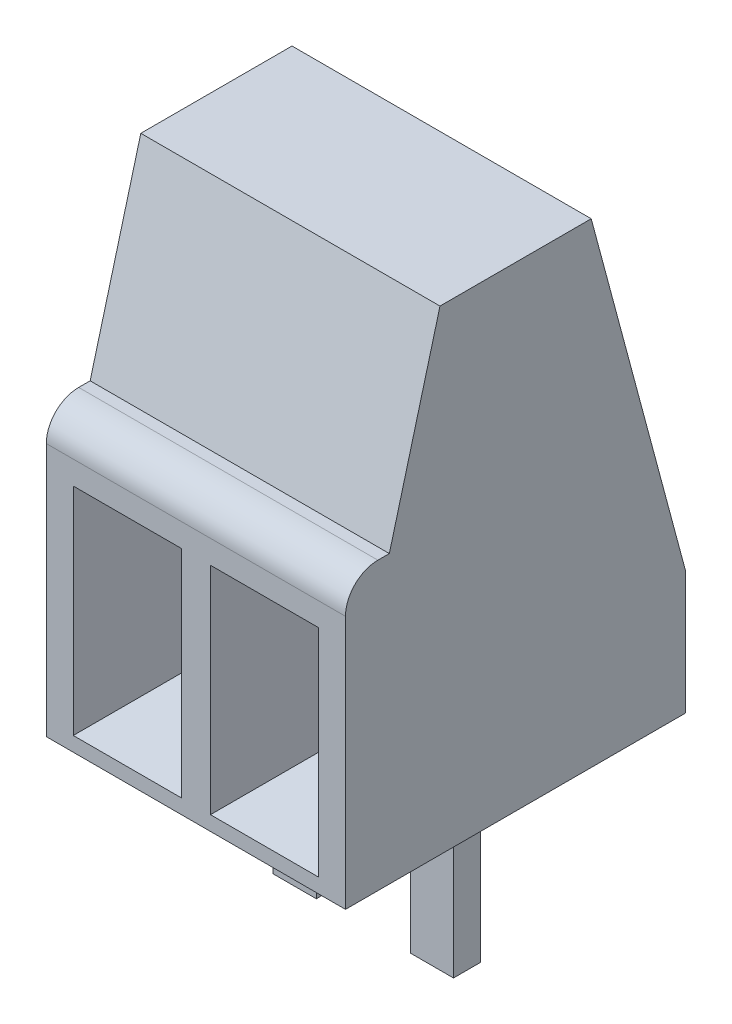
ISO-10303-21;
HEADER;
FILE_DESCRIPTION(('STEP AP214'),'2;1');
FILE_NAME('part.step','',(''),(''),'','','');
FILE_SCHEMA(('AUTOMOTIVE_DESIGN { 1 0 10303 214 1 1 1 1 }'));
ENDSEC;
DATA;
#1=APPLICATION_CONTEXT('core data for automotive mechanical design processes');
#2=APPLICATION_PROTOCOL_DEFINITION('international standard','automotive_design',2000,#1);
#3=PRODUCT_CONTEXT('',#1,'mechanical');
#4=PRODUCT('Part','Part','',(#3));
#5=PRODUCT_RELATED_PRODUCT_CATEGORY('part','',(#4));
#6=PRODUCT_DEFINITION_FORMATION('','',#4);
#7=PRODUCT_DEFINITION_CONTEXT('part definition',#1,'design');
#8=PRODUCT_DEFINITION('design','',#6,#7);
#9=PRODUCT_DEFINITION_SHAPE('','',#8);
#10=(LENGTH_UNIT() NAMED_UNIT(*) SI_UNIT(.MILLI.,.METRE.));
#11=(NAMED_UNIT(*) PLANE_ANGLE_UNIT() SI_UNIT($,.RADIAN.));
#12=(NAMED_UNIT(*) SI_UNIT($,.STERADIAN.) SOLID_ANGLE_UNIT());
#13=UNCERTAINTY_MEASURE_WITH_UNIT(LENGTH_MEASURE(1.E-05),#10,'distance_accuracy_value','');
#14=(GEOMETRIC_REPRESENTATION_CONTEXT(3) GLOBAL_UNCERTAINTY_ASSIGNED_CONTEXT((#13)) GLOBAL_UNIT_ASSIGNED_CONTEXT((#10,
#11,#12)) REPRESENTATION_CONTEXT('',''));
#15=CARTESIAN_POINT('',(0.,0.,0.));
#16=DIRECTION('',(0.,0.,1.));
#17=DIRECTION('',(1.,0.,0.));
#18=AXIS2_PLACEMENT_3D('',#15,#16,#17);
#19=CARTESIAN_POINT('',(2.77,8.8,3.15));
#20=DIRECTION('',(-1.,0.,0.));
#21=DIRECTION('',(0.,0.,1.));
#22=AXIS2_PLACEMENT_3D('',#19,#20,#21);
#23=PLANE('',#22);
#24=DIRECTION('',(0.,0.,-1.));
#25=VECTOR('',#24,1.);
#26=CARTESIAN_POINT('',(2.77,8.8,3.15));
#27=LINE('',#26,#25);
#28=CARTESIAN_POINT('',(2.77,8.8,1.4));
#29=VERTEX_POINT('',#28);
#30=CARTESIAN_POINT('',(2.77,8.8,-1.4));
#31=VERTEX_POINT('',#30);
#32=EDGE_CURVE('E361',#29,#31,#27,.T.);
#33=ORIENTED_EDGE('',*,*,#32,.F.);
#34=DIRECTION('',(0.,0.965925826289069,-0.258819045102518));
#35=VECTOR('',#34,1.);
#36=CARTESIAN_POINT('',(2.77,0.939488223348452,3.50621778264909));
#37=LINE('',#36,#35);
#38=CARTESIAN_POINT('',(2.77,5.3,2.33782217350892));
#39=VERTEX_POINT('',#38);
#40=EDGE_CURVE('E276',#39,#29,#37,.T.);
#41=ORIENTED_EDGE('',*,*,#40,.F.);
#42=DIRECTION('',(0.,0.,-1.));
#43=VECTOR('',#42,1.);
#44=CARTESIAN_POINT('',(2.77,5.3,0.));
#45=LINE('',#44,#43);
#46=CARTESIAN_POINT('',(2.77,5.3,2.55));
#47=VERTEX_POINT('',#46);
#48=EDGE_CURVE('E273',#47,#39,#45,.T.);
#49=ORIENTED_EDGE('',*,*,#48,.F.);
#50=CARTESIAN_POINT('',(2.77,4.7,2.55));
#51=DIRECTION('',(1.,0.,0.));
#52=DIRECTION('',(0.,0.,-1.));
#53=AXIS2_PLACEMENT_3D('',#50,#51,#52);
#54=CIRCLE('',#53,0.599999999999999);
#55=CARTESIAN_POINT('',(2.77,4.7,3.15));
#56=VERTEX_POINT('',#55);
#57=EDGE_CURVE('E270',#56,#47,#54,.F.);
#58=ORIENTED_EDGE('',*,*,#57,.F.);
#59=DIRECTION('',(0.,-1.,0.));
#60=VECTOR('',#59,1.);
#61=CARTESIAN_POINT('',(2.77,8.8,3.15));
#62=LINE('',#61,#60);
#63=CARTESIAN_POINT('',(2.77,0.,3.15));
#64=VERTEX_POINT('',#63);
#65=EDGE_CURVE('E368',#56,#64,#62,.T.);
#66=ORIENTED_EDGE('',*,*,#65,.T.);
#67=DIRECTION('',(0.,0.,-1.));
#68=VECTOR('',#67,1.);
#69=CARTESIAN_POINT('',(2.77,0.,3.15));
#70=LINE('',#69,#68);
#71=CARTESIAN_POINT('',(2.77,0.,-3.15));
#72=VERTEX_POINT('',#71);
#73=EDGE_CURVE('E352',#64,#72,#70,.T.);
#74=ORIENTED_EDGE('',*,*,#73,.T.);
#75=DIRECTION('',(0.,-1.,0.));
#76=VECTOR('',#75,1.);
#77=CARTESIAN_POINT('',(2.77,8.8,-3.15));
#78=LINE('',#77,#76);
#79=CARTESIAN_POINT('',(2.77,2.26891108675449,-3.15));
#80=VERTEX_POINT('',#79);
#81=EDGE_CURVE('E11',#80,#72,#78,.T.);
#82=ORIENTED_EDGE('',*,*,#81,.F.);
#83=DIRECTION('',(0.,-0.965925826289068,-0.258819045102522));
#84=VECTOR('',#83,1.);
#85=CARTESIAN_POINT('',(2.77,0.939488223348475,-3.50621778264911));
#86=LINE('',#85,#84);
#87=EDGE_CURVE('E222',#31,#80,#86,.T.);
#88=ORIENTED_EDGE('',*,*,#87,.F.);
#89=EDGE_LOOP('',(#33,#41,#49,#58,#66,#74,#82,#88));
#90=FACE_BOUND('',#89,.T.);
#91=ADVANCED_FACE('F33',(#90),#23,.F.);
#92=CARTESIAN_POINT('',(-2.77,8.8,-3.15));
#93=DIRECTION('',(0.,0.,1.));
#94=DIRECTION('',(1.,0.,0.));
#95=AXIS2_PLACEMENT_3D('',#92,#93,#94);
#96=PLANE('',#95);
#97=DIRECTION('',(0.,-1.,0.));
#98=VECTOR('',#97,1.);
#99=CARTESIAN_POINT('',(-2.77,8.8,-3.15));
#100=LINE('',#99,#98);
#101=CARTESIAN_POINT('',(-2.77,2.26891108675449,-3.15));
#102=VERTEX_POINT('',#101);
#103=CARTESIAN_POINT('',(-2.77,0.,-3.15));
#104=VERTEX_POINT('',#103);
#105=EDGE_CURVE('E40',#102,#104,#100,.T.);
#106=ORIENTED_EDGE('',*,*,#105,.F.);
#107=DIRECTION('',(1.,0.,0.));
#108=VECTOR('',#107,1.);
#109=CARTESIAN_POINT('',(-2.771,2.26891108675449,-3.15));
#110=LINE('',#109,#108);
#111=EDGE_CURVE('E292',#102,#80,#110,.T.);
#112=ORIENTED_EDGE('',*,*,#111,.T.);
#113=ORIENTED_EDGE('',*,*,#81,.T.);
#114=DIRECTION('',(-1.,0.,0.));
#115=VECTOR('',#114,1.);
#116=CARTESIAN_POINT('',(-2.77,0.,-3.15));
#117=LINE('',#116,#115);
#118=EDGE_CURVE('E371',#72,#104,#117,.T.);
#119=ORIENTED_EDGE('',*,*,#118,.T.);
#120=EDGE_LOOP('',(#106,#112,#113,#119));
#121=FACE_BOUND('',#120,.T.);
#122=ADVANCED_FACE('F392',(#121),#96,.F.);
#123=CARTESIAN_POINT('',(-2.77,8.8,3.15));
#124=DIRECTION('',(1.,0.,0.));
#125=DIRECTION('',(0.,0.,-1.));
#126=AXIS2_PLACEMENT_3D('',#123,#124,#125);
#127=PLANE('',#126);
#128=DIRECTION('',(0.,0.,1.));
#129=VECTOR('',#128,1.);
#130=CARTESIAN_POINT('',(-2.77,5.3,0.));
#131=LINE('',#130,#129);
#132=CARTESIAN_POINT('',(-2.77,5.3,2.33782217350892));
#133=VERTEX_POINT('',#132);
#134=CARTESIAN_POINT('',(-2.77,5.3,2.55));
#135=VERTEX_POINT('',#134);
#136=EDGE_CURVE('E263',#133,#135,#131,.T.);
#137=ORIENTED_EDGE('',*,*,#136,.F.);
#138=DIRECTION('',(0.,-0.965925826289069,0.258819045102518));
#139=VECTOR('',#138,1.);
#140=CARTESIAN_POINT('',(-2.77,0.939488223348452,3.50621778264909));
#141=LINE('',#140,#139);
#142=CARTESIAN_POINT('',(-2.77,8.8,1.4));
#143=VERTEX_POINT('',#142);
#144=EDGE_CURVE('E266',#143,#133,#141,.T.);
#145=ORIENTED_EDGE('',*,*,#144,.F.);
#146=DIRECTION('',(0.,0.,1.));
#147=VECTOR('',#146,1.);
#148=CARTESIAN_POINT('',(-2.77,8.8,3.15));
#149=LINE('',#148,#147);
#150=CARTESIAN_POINT('',(-2.77,8.8,-1.4));
#151=VERTEX_POINT('',#150);
#152=EDGE_CURVE('E364',#151,#143,#149,.T.);
#153=ORIENTED_EDGE('',*,*,#152,.F.);
#154=DIRECTION('',(0.,0.965925826289068,0.258819045102522));
#155=VECTOR('',#154,1.);
#156=CARTESIAN_POINT('',(-2.77,0.939488223348475,-3.50621778264911));
#157=LINE('',#156,#155);
#158=EDGE_CURVE('E267',#102,#151,#157,.T.);
#159=ORIENTED_EDGE('',*,*,#158,.F.);
#160=ORIENTED_EDGE('',*,*,#105,.T.);
#161=DIRECTION('',(0.,0.,1.));
#162=VECTOR('',#161,1.);
#163=CARTESIAN_POINT('',(-2.77,0.,3.15));
#164=LINE('',#163,#162);
#165=CARTESIAN_POINT('',(-2.77,0.,3.15));
#166=VERTEX_POINT('',#165);
#167=EDGE_CURVE('E374',#104,#166,#164,.T.);
#168=ORIENTED_EDGE('',*,*,#167,.T.);
#169=DIRECTION('',(0.,-1.,0.));
#170=VECTOR('',#169,1.);
#171=CARTESIAN_POINT('',(-2.77,8.8,3.15));
#172=LINE('',#171,#170);
#173=CARTESIAN_POINT('',(-2.77,4.7,3.15));
#174=VERTEX_POINT('',#173);
#175=EDGE_CURVE('E380',#174,#166,#172,.T.);
#176=ORIENTED_EDGE('',*,*,#175,.F.);
#177=CARTESIAN_POINT('',(-2.77,4.7,2.55));
#178=DIRECTION('',(1.,0.,0.));
#179=DIRECTION('',(0.,0.,-1.));
#180=AXIS2_PLACEMENT_3D('',#177,#178,#179);
#181=CIRCLE('',#180,0.599999999999999);
#182=EDGE_CURVE('E282',#135,#174,#181,.T.);
#183=ORIENTED_EDGE('',*,*,#182,.F.);
#184=EDGE_LOOP('',(#137,#145,#153,#159,#160,#168,#176,#183));
#185=FACE_BOUND('',#184,.T.);
#186=ADVANCED_FACE('F385',(#185),#127,.F.);
#187=CARTESIAN_POINT('',(-2.77,8.8,3.15));
#188=DIRECTION('',(0.,0.,-1.));
#189=DIRECTION('',(-1.,0.,0.));
#190=AXIS2_PLACEMENT_3D('',#187,#188,#189);
#191=PLANE('',#190);
#192=DIRECTION('',(-1.,0.,0.));
#193=VECTOR('',#192,1.);
#194=CARTESIAN_POINT('',(-2.27,4.26891108675449,3.15));
#195=LINE('',#194,#193);
#196=CARTESIAN_POINT('',(-0.27,4.26891108675449,3.15));
#197=VERTEX_POINT('',#196);
#198=CARTESIAN_POINT('',(-2.27,4.26891108675449,3.15));
#199=VERTEX_POINT('',#198);
#200=EDGE_CURVE('E207',#197,#199,#195,.T.);
#201=ORIENTED_EDGE('',*,*,#200,.F.);
#202=DIRECTION('',(0.,1.,0.));
#203=VECTOR('',#202,1.);
#204=CARTESIAN_POINT('',(-0.27,0.268911086754488,3.15));
#205=LINE('',#204,#203);
#206=CARTESIAN_POINT('',(-0.27,0.268911086754488,3.15));
#207=VERTEX_POINT('',#206);
#208=EDGE_CURVE('E47',#207,#197,#205,.T.);
#209=ORIENTED_EDGE('',*,*,#208,.F.);
#210=DIRECTION('',(1.,0.,0.));
#211=VECTOR('',#210,1.);
#212=CARTESIAN_POINT('',(-2.27,0.268911086754488,3.15));
#213=LINE('',#212,#211);
#214=CARTESIAN_POINT('',(-2.27,0.268911086754488,3.15));
#215=VERTEX_POINT('',#214);
#216=EDGE_CURVE('E214',#215,#207,#213,.T.);
#217=ORIENTED_EDGE('',*,*,#216,.F.);
#218=DIRECTION('',(0.,-1.,0.));
#219=VECTOR('',#218,1.);
#220=CARTESIAN_POINT('',(-2.27,0.268911086754488,3.15));
#221=LINE('',#220,#219);
#222=EDGE_CURVE('E196',#199,#215,#221,.T.);
#223=ORIENTED_EDGE('',*,*,#222,.F.);
#224=EDGE_LOOP('',(#201,#209,#217,#223));
#225=FACE_BOUND('',#224,.T.);
#226=DIRECTION('',(1.,0.,0.));
#227=VECTOR('',#226,1.);
#228=CARTESIAN_POINT('',(2.27,0.268911086754488,3.15));
#229=LINE('',#228,#227);
#230=CARTESIAN_POINT('',(0.27,0.268911086754487,3.15));
#231=VERTEX_POINT('',#230);
#232=CARTESIAN_POINT('',(2.27,0.268911086754488,3.15));
#233=VERTEX_POINT('',#232);
#234=EDGE_CURVE('E234',#231,#233,#229,.T.);
#235=ORIENTED_EDGE('',*,*,#234,.F.);
#236=DIRECTION('',(0.,-1.,0.));
#237=VECTOR('',#236,1.);
#238=CARTESIAN_POINT('',(0.269999999999999,4.26891108675449,3.15));
#239=LINE('',#238,#237);
#240=CARTESIAN_POINT('',(0.269999999999999,4.26891108675449,3.15));
#241=VERTEX_POINT('',#240);
#242=EDGE_CURVE('E55',#241,#231,#239,.T.);
#243=ORIENTED_EDGE('',*,*,#242,.F.);
#244=DIRECTION('',(-1.,0.,0.));
#245=VECTOR('',#244,1.);
#246=CARTESIAN_POINT('',(2.27,4.26891108675449,3.15));
#247=LINE('',#246,#245);
#248=CARTESIAN_POINT('',(2.27,4.26891108675449,3.15));
#249=VERTEX_POINT('',#248);
#250=EDGE_CURVE('E240',#249,#241,#247,.T.);
#251=ORIENTED_EDGE('',*,*,#250,.F.);
#252=DIRECTION('',(0.,1.,0.));
#253=VECTOR('',#252,1.);
#254=CARTESIAN_POINT('',(2.27,4.26891108675449,3.15));
#255=LINE('',#254,#253);
#256=EDGE_CURVE('E237',#233,#249,#255,.T.);
#257=ORIENTED_EDGE('',*,*,#256,.F.);
#258=EDGE_LOOP('',(#235,#243,#251,#257));
#259=FACE_BOUND('',#258,.T.);
#260=ORIENTED_EDGE('',*,*,#65,.F.);
#261=DIRECTION('',(1.,0.,0.));
#262=VECTOR('',#261,1.);
#263=CARTESIAN_POINT('',(-2.771,4.7,3.15));
#264=LINE('',#263,#262);
#265=EDGE_CURVE('E278',#174,#56,#264,.T.);
#266=ORIENTED_EDGE('',*,*,#265,.F.);
#267=ORIENTED_EDGE('',*,*,#175,.T.);
#268=DIRECTION('',(1.,0.,0.));
#269=VECTOR('',#268,1.);
#270=CARTESIAN_POINT('',(-2.77,0.,3.15));
#271=LINE('',#270,#269);
#272=EDGE_CURVE('E365',#166,#64,#271,.T.);
#273=ORIENTED_EDGE('',*,*,#272,.T.);
#274=EDGE_LOOP('',(#260,#266,#267,#273));
#275=FACE_BOUND('',#274,.T.);
#276=ADVANCED_FACE('F211',(#225,#259,#275),#191,.F.);
#277=CARTESIAN_POINT('',(0.,8.8,0.));
#278=DIRECTION('',(0.,-1.,0.));
#279=DIRECTION('',(0.,0.,-1.));
#280=AXIS2_PLACEMENT_3D('',#277,#278,#279);
#281=PLANE('',#280);
#282=ORIENTED_EDGE('',*,*,#152,.T.);
#283=DIRECTION('',(1.,0.,0.));
#284=VECTOR('',#283,1.);
#285=CARTESIAN_POINT('',(-2.771,8.8,1.4));
#286=LINE('',#285,#284);
#287=EDGE_CURVE('E279',#143,#29,#286,.T.);
#288=ORIENTED_EDGE('',*,*,#287,.T.);
#289=ORIENTED_EDGE('',*,*,#32,.T.);
#290=DIRECTION('',(1.,0.,0.));
#291=VECTOR('',#290,1.);
#292=CARTESIAN_POINT('',(-2.771,8.8,-1.4));
#293=LINE('',#292,#291);
#294=EDGE_CURVE('E291',#151,#31,#293,.T.);
#295=ORIENTED_EDGE('',*,*,#294,.F.);
#296=EDGE_LOOP('',(#282,#288,#289,#295));
#297=FACE_BOUND('',#296,.T.);
#298=ADVANCED_FACE('F413',(#297),#281,.F.);
#299=CARTESIAN_POINT('',(0.,0.,0.));
#300=DIRECTION('',(0.,-1.,0.));
#301=DIRECTION('',(0.,0.,-1.));
#302=AXIS2_PLACEMENT_3D('',#299,#300,#301);
#303=PLANE('',#302);
#304=DIRECTION('',(0.,0.,1.));
#305=VECTOR('',#304,1.);
#306=CARTESIAN_POINT('',(-1.67,0.,0.050000000000001));
#307=LINE('',#306,#305);
#308=CARTESIAN_POINT('',(-1.67,0.,-0.449999999999999));
#309=VERTEX_POINT('',#308);
#310=CARTESIAN_POINT('',(-1.67,0.,0.050000000000001));
#311=VERTEX_POINT('',#310);
#312=EDGE_CURVE('E289',#309,#311,#307,.T.);
#313=ORIENTED_EDGE('',*,*,#312,.T.);
#314=DIRECTION('',(1.,0.,0.));
#315=VECTOR('',#314,1.);
#316=CARTESIAN_POINT('',(-0.87,0.,0.0500000000000008));
#317=LINE('',#316,#315);
#318=CARTESIAN_POINT('',(-0.87,0.,0.0500000000000008));
#319=VERTEX_POINT('',#318);
#320=EDGE_CURVE('E312',#311,#319,#317,.T.);
#321=ORIENTED_EDGE('',*,*,#320,.T.);
#322=DIRECTION('',(0.,0.,-1.));
#323=VECTOR('',#322,1.);
#324=CARTESIAN_POINT('',(-0.87,0.,0.0500000000000008));
#325=LINE('',#324,#323);
#326=CARTESIAN_POINT('',(-0.87,0.,-0.449999999999999));
#327=VERTEX_POINT('',#326);
#328=EDGE_CURVE('E314',#319,#327,#325,.T.);
#329=ORIENTED_EDGE('',*,*,#328,.T.);
#330=DIRECTION('',(-1.,0.,0.));
#331=VECTOR('',#330,1.);
#332=CARTESIAN_POINT('',(-0.87,0.,-0.449999999999999));
#333=LINE('',#332,#331);
#334=EDGE_CURVE('E301',#327,#309,#333,.T.);
#335=ORIENTED_EDGE('',*,*,#334,.T.);
#336=EDGE_LOOP('',(#313,#321,#329,#335));
#337=FACE_BOUND('',#336,.T.);
#338=DIRECTION('',(0.,0.,-1.));
#339=VECTOR('',#338,1.);
#340=CARTESIAN_POINT('',(1.67,0.,0.0500000000000007));
#341=LINE('',#340,#339);
#342=CARTESIAN_POINT('',(1.67,0.,0.0500000000000007));
#343=VERTEX_POINT('',#342);
#344=CARTESIAN_POINT('',(1.67,0.,-0.449999999999999));
#345=VERTEX_POINT('',#344);
#346=EDGE_CURVE('E320',#343,#345,#341,.T.);
#347=ORIENTED_EDGE('',*,*,#346,.T.);
#348=DIRECTION('',(-1.,0.,0.));
#349=VECTOR('',#348,1.);
#350=CARTESIAN_POINT('',(0.87,0.,-0.449999999999999));
#351=LINE('',#350,#349);
#352=CARTESIAN_POINT('',(0.87,0.,-0.449999999999999));
#353=VERTEX_POINT('',#352);
#354=EDGE_CURVE('E344',#345,#353,#351,.T.);
#355=ORIENTED_EDGE('',*,*,#354,.T.);
#356=DIRECTION('',(0.,0.,1.));
#357=VECTOR('',#356,1.);
#358=CARTESIAN_POINT('',(0.87,0.,0.0500000000000007));
#359=LINE('',#358,#357);
#360=CARTESIAN_POINT('',(0.87,0.,0.0500000000000007));
#361=VERTEX_POINT('',#360);
#362=EDGE_CURVE('E346',#353,#361,#359,.T.);
#363=ORIENTED_EDGE('',*,*,#362,.T.);
#364=DIRECTION('',(1.,0.,0.));
#365=VECTOR('',#364,1.);
#366=CARTESIAN_POINT('',(0.87,0.,0.0500000000000007));
#367=LINE('',#366,#365);
#368=EDGE_CURVE('E333',#361,#343,#367,.T.);
#369=ORIENTED_EDGE('',*,*,#368,.T.);
#370=EDGE_LOOP('',(#347,#355,#363,#369));
#371=FACE_BOUND('',#370,.T.);
#372=ORIENTED_EDGE('',*,*,#73,.F.);
#373=ORIENTED_EDGE('',*,*,#272,.F.);
#374=ORIENTED_EDGE('',*,*,#167,.F.);
#375=ORIENTED_EDGE('',*,*,#118,.F.);
#376=EDGE_LOOP('',(#372,#373,#374,#375));
#377=FACE_BOUND('',#376,.T.);
#378=ADVANCED_FACE('F396',(#337,#371,#377),#303,.T.);
#379=CARTESIAN_POINT('',(1.67,-3.2,0.0500000000000007));
#380=DIRECTION('',(1.,0.,0.));
#381=DIRECTION('',(0.,0.,-1.));
#382=AXIS2_PLACEMENT_3D('',#379,#380,#381);
#383=PLANE('',#382);
#384=ORIENTED_EDGE('',*,*,#346,.F.);
#385=DIRECTION('',(0.,1.,0.));
#386=VECTOR('',#385,1.);
#387=CARTESIAN_POINT('',(1.67,-3.2,0.0500000000000007));
#388=LINE('',#387,#386);
#389=CARTESIAN_POINT('',(1.67,-3.2,0.0500000000000007));
#390=VERTEX_POINT('',#389);
#391=EDGE_CURVE('E349',#390,#343,#388,.T.);
#392=ORIENTED_EDGE('',*,*,#391,.F.);
#393=DIRECTION('',(0.,0.,-1.));
#394=VECTOR('',#393,1.);
#395=CARTESIAN_POINT('',(1.67,-3.2,0.0500000000000007));
#396=LINE('',#395,#394);
#397=CARTESIAN_POINT('',(1.67,-3.2,-0.449999999999999));
#398=VERTEX_POINT('',#397);
#399=EDGE_CURVE('E329',#390,#398,#396,.T.);
#400=ORIENTED_EDGE('',*,*,#399,.T.);
#401=DIRECTION('',(0.,1.,0.));
#402=VECTOR('',#401,1.);
#403=CARTESIAN_POINT('',(1.67,-3.2,-0.449999999999999));
#404=LINE('',#403,#402);
#405=EDGE_CURVE('E342',#398,#345,#404,.T.);
#406=ORIENTED_EDGE('',*,*,#405,.T.);
#407=EDGE_LOOP('',(#384,#392,#400,#406));
#408=FACE_BOUND('',#407,.T.);
#409=ADVANCED_FACE('F432',(#408),#383,.T.);
#410=CARTESIAN_POINT('',(0.87,-3.2,0.0500000000000007));
#411=DIRECTION('',(0.,0.,1.));
#412=DIRECTION('',(1.,0.,0.));
#413=AXIS2_PLACEMENT_3D('',#410,#411,#412);
#414=PLANE('',#413);
#415=ORIENTED_EDGE('',*,*,#368,.F.);
#416=DIRECTION('',(0.,1.,0.));
#417=VECTOR('',#416,1.);
#418=CARTESIAN_POINT('',(0.87,-3.2,0.0500000000000007));
#419=LINE('',#418,#417);
#420=CARTESIAN_POINT('',(0.87,-3.2,0.0500000000000007));
#421=VERTEX_POINT('',#420);
#422=EDGE_CURVE('E353',#421,#361,#419,.T.);
#423=ORIENTED_EDGE('',*,*,#422,.F.);
#424=DIRECTION('',(1.,0.,0.));
#425=VECTOR('',#424,1.);
#426=CARTESIAN_POINT('',(0.87,-3.2,0.0500000000000007));
#427=LINE('',#426,#425);
#428=EDGE_CURVE('E339',#421,#390,#427,.T.);
#429=ORIENTED_EDGE('',*,*,#428,.T.);
#430=ORIENTED_EDGE('',*,*,#391,.T.);
#431=EDGE_LOOP('',(#415,#423,#429,#430));
#432=FACE_BOUND('',#431,.T.);
#433=ADVANCED_FACE('F438',(#432),#414,.T.);
#434=CARTESIAN_POINT('',(0.87,-3.2,0.0500000000000007));
#435=DIRECTION('',(-1.,0.,0.));
#436=DIRECTION('',(0.,0.,1.));
#437=AXIS2_PLACEMENT_3D('',#434,#435,#436);
#438=PLANE('',#437);
#439=ORIENTED_EDGE('',*,*,#362,.F.);
#440=DIRECTION('',(0.,1.,0.));
#441=VECTOR('',#440,1.);
#442=CARTESIAN_POINT('',(0.87,-3.2,-0.449999999999999));
#443=LINE('',#442,#441);
#444=CARTESIAN_POINT('',(0.87,-3.2,-0.449999999999999));
#445=VERTEX_POINT('',#444);
#446=EDGE_CURVE('E356',#445,#353,#443,.T.);
#447=ORIENTED_EDGE('',*,*,#446,.F.);
#448=DIRECTION('',(0.,0.,1.));
#449=VECTOR('',#448,1.);
#450=CARTESIAN_POINT('',(0.87,-3.2,0.0500000000000007));
#451=LINE('',#450,#449);
#452=EDGE_CURVE('E336',#445,#421,#451,.T.);
#453=ORIENTED_EDGE('',*,*,#452,.T.);
#454=ORIENTED_EDGE('',*,*,#422,.T.);
#455=EDGE_LOOP('',(#439,#447,#453,#454));
#456=FACE_BOUND('',#455,.T.);
#457=ADVANCED_FACE('F444',(#456),#438,.T.);
#458=CARTESIAN_POINT('',(0.87,-3.2,-0.449999999999999));
#459=DIRECTION('',(0.,0.,-1.));
#460=DIRECTION('',(-1.,0.,0.));
#461=AXIS2_PLACEMENT_3D('',#458,#459,#460);
#462=PLANE('',#461);
#463=ORIENTED_EDGE('',*,*,#354,.F.);
#464=ORIENTED_EDGE('',*,*,#405,.F.);
#465=DIRECTION('',(-1.,0.,0.));
#466=VECTOR('',#465,1.);
#467=CARTESIAN_POINT('',(0.87,-3.2,-0.449999999999999));
#468=LINE('',#467,#466);
#469=EDGE_CURVE('E332',#398,#445,#468,.T.);
#470=ORIENTED_EDGE('',*,*,#469,.T.);
#471=ORIENTED_EDGE('',*,*,#446,.T.);
#472=EDGE_LOOP('',(#463,#464,#470,#471));
#473=FACE_BOUND('',#472,.T.);
#474=ADVANCED_FACE('F440',(#473),#462,.T.);
#475=CARTESIAN_POINT('',(0.,-3.2,0.));
#476=DIRECTION('',(0.,-1.,0.));
#477=DIRECTION('',(0.,0.,-1.));
#478=AXIS2_PLACEMENT_3D('',#475,#476,#477);
#479=PLANE('',#478);
#480=ORIENTED_EDGE('',*,*,#399,.F.);
#481=ORIENTED_EDGE('',*,*,#428,.F.);
#482=ORIENTED_EDGE('',*,*,#452,.F.);
#483=ORIENTED_EDGE('',*,*,#469,.F.);
#484=EDGE_LOOP('',(#480,#481,#482,#483));
#485=FACE_BOUND('',#484,.T.);
#486=ADVANCED_FACE('F443',(#485),#479,.T.);
#487=CARTESIAN_POINT('',(-1.67,-3.2,0.050000000000001));
#488=DIRECTION('',(-1.,0.,0.));
#489=DIRECTION('',(0.,0.,1.));
#490=AXIS2_PLACEMENT_3D('',#487,#488,#489);
#491=PLANE('',#490);
#492=ORIENTED_EDGE('',*,*,#312,.F.);
#493=DIRECTION('',(0.,1.,0.));
#494=VECTOR('',#493,1.);
#495=CARTESIAN_POINT('',(-1.67,-3.2,-0.449999999999999));
#496=LINE('',#495,#494);
#497=CARTESIAN_POINT('',(-1.67,-3.2,-0.449999999999999));
#498=VERTEX_POINT('',#497);
#499=EDGE_CURVE('E317',#498,#309,#496,.T.);
#500=ORIENTED_EDGE('',*,*,#499,.F.);
#501=DIRECTION('',(0.,0.,1.));
#502=VECTOR('',#501,1.);
#503=CARTESIAN_POINT('',(-1.67,-3.2,0.050000000000001));
#504=LINE('',#503,#502);
#505=CARTESIAN_POINT('',(-1.67,-3.2,0.050000000000001));
#506=VERTEX_POINT('',#505);
#507=EDGE_CURVE('E297',#498,#506,#504,.T.);
#508=ORIENTED_EDGE('',*,*,#507,.T.);
#509=DIRECTION('',(0.,1.,0.));
#510=VECTOR('',#509,1.);
#511=CARTESIAN_POINT('',(-1.67,-3.2,0.050000000000001));
#512=LINE('',#511,#510);
#513=EDGE_CURVE('E310',#506,#311,#512,.T.);
#514=ORIENTED_EDGE('',*,*,#513,.T.);
#515=EDGE_LOOP('',(#492,#500,#508,#514));
#516=FACE_BOUND('',#515,.T.);
#517=ADVANCED_FACE('F454',(#516),#491,.T.);
#518=CARTESIAN_POINT('',(-0.87,-3.2,-0.449999999999999));
#519=DIRECTION('',(0.,0.,-1.));
#520=DIRECTION('',(-1.,0.,0.));
#521=AXIS2_PLACEMENT_3D('',#518,#519,#520);
#522=PLANE('',#521);
#523=ORIENTED_EDGE('',*,*,#334,.F.);
#524=DIRECTION('',(0.,1.,0.));
#525=VECTOR('',#524,1.);
#526=CARTESIAN_POINT('',(-0.87,-3.2,-0.449999999999999));
#527=LINE('',#526,#525);
#528=CARTESIAN_POINT('',(-0.87,-3.2,-0.449999999999999));
#529=VERTEX_POINT('',#528);
#530=EDGE_CURVE('E321',#529,#327,#527,.T.);
#531=ORIENTED_EDGE('',*,*,#530,.F.);
#532=DIRECTION('',(-1.,0.,0.));
#533=VECTOR('',#532,1.);
#534=CARTESIAN_POINT('',(-0.87,-3.2,-0.449999999999999));
#535=LINE('',#534,#533);
#536=EDGE_CURVE('E307',#529,#498,#535,.T.);
#537=ORIENTED_EDGE('',*,*,#536,.T.);
#538=ORIENTED_EDGE('',*,*,#499,.T.);
#539=EDGE_LOOP('',(#523,#531,#537,#538));
#540=FACE_BOUND('',#539,.T.);
#541=ADVANCED_FACE('F458',(#540),#522,.T.);
#542=CARTESIAN_POINT('',(-0.87,-3.2,0.0500000000000008));
#543=DIRECTION('',(1.,0.,0.));
#544=DIRECTION('',(0.,0.,-1.));
#545=AXIS2_PLACEMENT_3D('',#542,#543,#544);
#546=PLANE('',#545);
#547=ORIENTED_EDGE('',*,*,#328,.F.);
#548=DIRECTION('',(0.,1.,0.));
#549=VECTOR('',#548,1.);
#550=CARTESIAN_POINT('',(-0.87,-3.2,0.0500000000000008));
#551=LINE('',#550,#549);
#552=CARTESIAN_POINT('',(-0.87,-3.2,0.0500000000000008));
#553=VERTEX_POINT('',#552);
#554=EDGE_CURVE('E324',#553,#319,#551,.T.);
#555=ORIENTED_EDGE('',*,*,#554,.F.);
#556=DIRECTION('',(0.,0.,-1.));
#557=VECTOR('',#556,1.);
#558=CARTESIAN_POINT('',(-0.87,-3.2,0.0500000000000008));
#559=LINE('',#558,#557);
#560=EDGE_CURVE('E304',#553,#529,#559,.T.);
#561=ORIENTED_EDGE('',*,*,#560,.T.);
#562=ORIENTED_EDGE('',*,*,#530,.T.);
#563=EDGE_LOOP('',(#547,#555,#561,#562));
#564=FACE_BOUND('',#563,.T.);
#565=ADVANCED_FACE('F464',(#564),#546,.T.);
#566=CARTESIAN_POINT('',(-0.87,-3.2,0.0500000000000008));
#567=DIRECTION('',(0.,0.,1.));
#568=DIRECTION('',(1.,0.,0.));
#569=AXIS2_PLACEMENT_3D('',#566,#567,#568);
#570=PLANE('',#569);
#571=ORIENTED_EDGE('',*,*,#320,.F.);
#572=ORIENTED_EDGE('',*,*,#513,.F.);
#573=DIRECTION('',(1.,0.,0.));
#574=VECTOR('',#573,1.);
#575=CARTESIAN_POINT('',(-0.87,-3.2,0.0500000000000008));
#576=LINE('',#575,#574);
#577=EDGE_CURVE('E300',#506,#553,#576,.T.);
#578=ORIENTED_EDGE('',*,*,#577,.T.);
#579=ORIENTED_EDGE('',*,*,#554,.T.);
#580=EDGE_LOOP('',(#571,#572,#578,#579));
#581=FACE_BOUND('',#580,.T.);
#582=ADVANCED_FACE('F460',(#581),#570,.T.);
#583=CARTESIAN_POINT('',(0.,-3.2,0.));
#584=DIRECTION('',(0.,1.,0.));
#585=DIRECTION('',(0.,0.,1.));
#586=AXIS2_PLACEMENT_3D('',#583,#584,#585);
#587=PLANE('',#586);
#588=ORIENTED_EDGE('',*,*,#507,.F.);
#589=ORIENTED_EDGE('',*,*,#536,.F.);
#590=ORIENTED_EDGE('',*,*,#560,.F.);
#591=ORIENTED_EDGE('',*,*,#577,.F.);
#592=EDGE_LOOP('',(#588,#589,#590,#591));
#593=FACE_BOUND('',#592,.T.);
#594=ADVANCED_FACE('F463',(#593),#587,.F.);
#595=CARTESIAN_POINT('',(-2.771,0.939488223348475,-3.50621778264911));
#596=DIRECTION('',(0.,-0.258819045102522,0.965925826289068));
#597=DIRECTION('',(0.,-0.965925826289068,-0.258819045102522));
#598=AXIS2_PLACEMENT_3D('',#595,#596,#597);
#599=PLANE('',#598);
#600=ORIENTED_EDGE('',*,*,#158,.T.);
#601=ORIENTED_EDGE('',*,*,#294,.T.);
#602=ORIENTED_EDGE('',*,*,#87,.T.);
#603=ORIENTED_EDGE('',*,*,#111,.F.);
#604=EDGE_LOOP('',(#600,#601,#602,#603));
#605=FACE_BOUND('',#604,.T.);
#606=ADVANCED_FACE('F417',(#605),#599,.F.);
#607=CARTESIAN_POINT('',(-2.771,0.939488223348452,3.50621778264909));
#608=DIRECTION('',(0.,-0.258819045102518,-0.965925826289069));
#609=DIRECTION('',(0.,0.965925826289069,-0.258819045102518));
#610=AXIS2_PLACEMENT_3D('',#607,#608,#609);
#611=PLANE('',#610);
#612=ORIENTED_EDGE('',*,*,#144,.T.);
#613=DIRECTION('',(1.,0.,0.));
#614=VECTOR('',#613,1.);
#615=CARTESIAN_POINT('',(-2.771,5.3,2.33782217350892));
#616=LINE('',#615,#614);
#617=EDGE_CURVE('E283',#133,#39,#616,.T.);
#618=ORIENTED_EDGE('',*,*,#617,.T.);
#619=ORIENTED_EDGE('',*,*,#40,.T.);
#620=ORIENTED_EDGE('',*,*,#287,.F.);
#621=EDGE_LOOP('',(#612,#618,#619,#620));
#622=FACE_BOUND('',#621,.T.);
#623=ADVANCED_FACE('F410',(#622),#611,.F.);
#624=CARTESIAN_POINT('',(-2.771,5.3,0.));
#625=DIRECTION('',(0.,-1.,0.));
#626=DIRECTION('',(0.,0.,-1.));
#627=AXIS2_PLACEMENT_3D('',#624,#625,#626);
#628=PLANE('',#627);
#629=ORIENTED_EDGE('',*,*,#136,.T.);
#630=DIRECTION('',(1.,0.,0.));
#631=VECTOR('',#630,1.);
#632=CARTESIAN_POINT('',(-2.771,5.3,2.55));
#633=LINE('',#632,#631);
#634=EDGE_CURVE('E285',#135,#47,#633,.T.);
#635=ORIENTED_EDGE('',*,*,#634,.T.);
#636=ORIENTED_EDGE('',*,*,#48,.T.);
#637=ORIENTED_EDGE('',*,*,#617,.F.);
#638=EDGE_LOOP('',(#629,#635,#636,#637));
#639=FACE_BOUND('',#638,.T.);
#640=ADVANCED_FACE('F407',(#639),#628,.F.);
#641=CARTESIAN_POINT('',(-2.771,4.7,2.55));
#642=DIRECTION('',(1.,0.,0.));
#643=DIRECTION('',(0.,0.,-1.));
#644=AXIS2_PLACEMENT_3D('',#641,#642,#643);
#645=CYLINDRICAL_SURFACE('',#644,0.599999999999999);
#646=ORIENTED_EDGE('',*,*,#182,.T.);
#647=ORIENTED_EDGE('',*,*,#265,.T.);
#648=ORIENTED_EDGE('',*,*,#57,.T.);
#649=ORIENTED_EDGE('',*,*,#634,.F.);
#650=EDGE_LOOP('',(#646,#647,#648,#649));
#651=FACE_BOUND('',#650,.T.);
#652=ADVANCED_FACE('F403',(#651),#645,.T.);
#653=CARTESIAN_POINT('',(0.269999999999999,4.26891108675449,3.15));
#654=DIRECTION('',(-0.984807753012208,0.,-0.173648177666931));
#655=DIRECTION('',(-0.173648177666931,0.,0.984807753012208));
#656=AXIS2_PLACEMENT_3D('',#653,#654,#655);
#657=PLANE('',#656);
#658=ORIENTED_EDGE('',*,*,#242,.T.);
#659=DIRECTION('',(-0.171087869746036,-0.171087869746036,0.970287525247814));
#660=VECTOR('',#659,1.);
#661=CARTESIAN_POINT('',(0.387084236696946,0.385995323451434,2.48598229705679));
#662=LINE('',#661,#660);
#663=CARTESIAN_POINT('',(0.825429989231666,0.824341075986154,0.));
#664=VERTEX_POINT('',#663);
#665=EDGE_CURVE('E247',#664,#231,#662,.T.);
#666=ORIENTED_EDGE('',*,*,#665,.F.);
#667=DIRECTION('',(0.,-1.,0.));
#668=VECTOR('',#667,1.);
#669=CARTESIAN_POINT('',(0.825429989231665,4.26891108675449,0.));
#670=LINE('',#669,#668);
#671=CARTESIAN_POINT('',(0.825429989231665,3.71348109752282,0.));
#672=VERTEX_POINT('',#671);
#673=EDGE_CURVE('E243',#672,#664,#670,.T.);
#674=ORIENTED_EDGE('',*,*,#673,.F.);
#675=DIRECTION('',(-0.171087869746036,0.171087869746036,0.970287525247814));
#676=VECTOR('',#675,1.);
#677=CARTESIAN_POINT('',(0.328542118348473,4.21036896840601,2.8179911485284));
#678=LINE('',#677,#676);
#679=EDGE_CURVE('E244',#672,#241,#678,.T.);
#680=ORIENTED_EDGE('',*,*,#679,.T.);
#681=EDGE_LOOP('',(#658,#666,#674,#680));
#682=FACE_BOUND('',#681,.T.);
#683=ADVANCED_FACE('F479',(#682),#657,.F.);
#684=CARTESIAN_POINT('',(2.27,4.26891108675449,3.15));
#685=DIRECTION('',(0.,0.984807753012208,-0.173648177666931));
#686=DIRECTION('',(0.,0.173648177666931,0.984807753012208));
#687=AXIS2_PLACEMENT_3D('',#684,#685,#686);
#688=PLANE('',#687);
#689=ORIENTED_EDGE('',*,*,#250,.T.);
#690=ORIENTED_EDGE('',*,*,#679,.F.);
#691=DIRECTION('',(-1.,0.,0.));
#692=VECTOR('',#691,1.);
#693=CARTESIAN_POINT('',(2.27,3.71348109752282,0.));
#694=LINE('',#693,#692);
#695=CARTESIAN_POINT('',(1.71457001076833,3.71348109752282,0.));
#696=VERTEX_POINT('',#695);
#697=EDGE_CURVE('E250',#696,#672,#694,.T.);
#698=ORIENTED_EDGE('',*,*,#697,.F.);
#699=DIRECTION('',(0.171087869746036,0.171087869746036,0.970287525247814));
#700=VECTOR('',#699,1.);
#701=CARTESIAN_POINT('',(2.27,4.26891108675449,3.15));
#702=LINE('',#701,#700);
#703=EDGE_CURVE('E246',#696,#249,#702,.T.);
#704=ORIENTED_EDGE('',*,*,#703,.T.);
#705=EDGE_LOOP('',(#689,#690,#698,#704));
#706=FACE_BOUND('',#705,.T.);
#707=ADVANCED_FACE('F484',(#706),#688,.F.);
#708=CARTESIAN_POINT('',(2.27,4.26891108675449,3.15));
#709=DIRECTION('',(0.984807753012208,0.,-0.173648177666931));
#710=DIRECTION('',(-0.173648177666931,0.,-0.984807753012208));
#711=AXIS2_PLACEMENT_3D('',#708,#709,#710);
#712=PLANE('',#711);
#713=ORIENTED_EDGE('',*,*,#256,.T.);
#714=ORIENTED_EDGE('',*,*,#703,.F.);
#715=DIRECTION('',(0.,1.,0.));
#716=VECTOR('',#715,1.);
#717=CARTESIAN_POINT('',(1.71457001076833,4.26891108675449,0.));
#718=LINE('',#717,#716);
#719=CARTESIAN_POINT('',(1.71457001076833,0.824341075986154,0.));
#720=VERTEX_POINT('',#719);
#721=EDGE_CURVE('E258',#720,#696,#718,.T.);
#722=ORIENTED_EDGE('',*,*,#721,.F.);
#723=DIRECTION('',(0.171087869746036,-0.171087869746036,0.970287525247814));
#724=VECTOR('',#723,1.);
#725=CARTESIAN_POINT('',(2.27,0.268911086754488,3.15));
#726=LINE('',#725,#724);
#727=EDGE_CURVE('E249',#720,#233,#726,.T.);
#728=ORIENTED_EDGE('',*,*,#727,.T.);
#729=EDGE_LOOP('',(#713,#714,#722,#728));
#730=FACE_BOUND('',#729,.T.);
#731=ADVANCED_FACE('F487',(#730),#712,.F.);
#732=CARTESIAN_POINT('',(2.27,0.268911086754488,3.15));
#733=DIRECTION('',(0.,-0.984807753012208,-0.173648177666931));
#734=DIRECTION('',(0.,0.173648177666931,-0.984807753012208));
#735=AXIS2_PLACEMENT_3D('',#732,#733,#734);
#736=PLANE('',#735);
#737=ORIENTED_EDGE('',*,*,#234,.T.);
#738=ORIENTED_EDGE('',*,*,#727,.F.);
#739=DIRECTION('',(1.,0.,0.));
#740=VECTOR('',#739,1.);
#741=CARTESIAN_POINT('',(2.27,0.824341075986154,0.));
#742=LINE('',#741,#740);
#743=EDGE_CURVE('E255',#664,#720,#742,.T.);
#744=ORIENTED_EDGE('',*,*,#743,.F.);
#745=ORIENTED_EDGE('',*,*,#665,.T.);
#746=EDGE_LOOP('',(#737,#738,#744,#745));
#747=FACE_BOUND('',#746,.T.);
#748=ADVANCED_FACE('F491',(#747),#736,.F.);
#749=CARTESIAN_POINT('',(0.,0.,0.));
#750=DIRECTION('',(0.,0.,-1.));
#751=DIRECTION('',(-1.,0.,0.));
#752=AXIS2_PLACEMENT_3D('',#749,#750,#751);
#753=PLANE('',#752);
#754=ORIENTED_EDGE('',*,*,#673,.T.);
#755=ORIENTED_EDGE('',*,*,#743,.T.);
#756=ORIENTED_EDGE('',*,*,#721,.T.);
#757=ORIENTED_EDGE('',*,*,#697,.T.);
#758=EDGE_LOOP('',(#754,#755,#756,#757));
#759=FACE_BOUND('',#758,.T.);
#760=ADVANCED_FACE('F495',(#759),#753,.F.);
#761=CARTESIAN_POINT('',(-0.27,0.268911086754488,3.15));
#762=DIRECTION('',(0.984807753012208,0.,-0.173648177666931));
#763=DIRECTION('',(-0.173648177666931,0.,-0.984807753012208));
#764=AXIS2_PLACEMENT_3D('',#761,#762,#763);
#765=PLANE('',#764);
#766=ORIENTED_EDGE('',*,*,#208,.T.);
#767=DIRECTION('',(0.171087869746036,0.171087869746036,0.970287525247814));
#768=VECTOR('',#767,1.);
#769=CARTESIAN_POINT('',(-0.387084236696946,4.15182685005754,2.48598229705679));
#770=LINE('',#769,#768);
#771=CARTESIAN_POINT('',(-0.825429989231666,3.71348109752282,0.));
#772=VERTEX_POINT('',#771);
#773=EDGE_CURVE('E204',#772,#197,#770,.T.);
#774=ORIENTED_EDGE('',*,*,#773,.F.);
#775=DIRECTION('',(0.,1.,0.));
#776=VECTOR('',#775,1.);
#777=CARTESIAN_POINT('',(-0.825429989231666,0.268911086754488,0.));
#778=LINE('',#777,#776);
#779=CARTESIAN_POINT('',(-0.825429989231666,0.824341075986154,0.));
#780=VERTEX_POINT('',#779);
#781=EDGE_CURVE('E216',#780,#772,#778,.T.);
#782=ORIENTED_EDGE('',*,*,#781,.F.);
#783=DIRECTION('',(0.171087869746036,-0.171087869746036,0.970287525247814));
#784=VECTOR('',#783,1.);
#785=CARTESIAN_POINT('',(-0.328542118348474,0.327453205102961,2.8179911485284));
#786=LINE('',#785,#784);
#787=EDGE_CURVE('E220',#780,#207,#786,.T.);
#788=ORIENTED_EDGE('',*,*,#787,.T.);
#789=EDGE_LOOP('',(#766,#774,#782,#788));
#790=FACE_BOUND('',#789,.T.);
#791=ADVANCED_FACE('F501',(#790),#765,.F.);
#792=CARTESIAN_POINT('',(-2.27,0.268911086754488,3.15));
#793=DIRECTION('',(0.,-0.984807753012208,-0.173648177666931));
#794=DIRECTION('',(0.,0.173648177666931,-0.984807753012208));
#795=AXIS2_PLACEMENT_3D('',#792,#793,#794);
#796=PLANE('',#795);
#797=ORIENTED_EDGE('',*,*,#216,.T.);
#798=ORIENTED_EDGE('',*,*,#787,.F.);
#799=DIRECTION('',(1.,0.,0.));
#800=VECTOR('',#799,1.);
#801=CARTESIAN_POINT('',(-2.27,0.824341075986154,0.));
#802=LINE('',#801,#800);
#803=CARTESIAN_POINT('',(-1.71457001076833,0.824341075986154,0.));
#804=VERTEX_POINT('',#803);
#805=EDGE_CURVE('E223',#804,#780,#802,.T.);
#806=ORIENTED_EDGE('',*,*,#805,.F.);
#807=DIRECTION('',(-0.171087869746036,-0.171087869746036,0.970287525247814));
#808=VECTOR('',#807,1.);
#809=CARTESIAN_POINT('',(-2.27,0.268911086754488,3.15));
#810=LINE('',#809,#808);
#811=EDGE_CURVE('E203',#804,#215,#810,.T.);
#812=ORIENTED_EDGE('',*,*,#811,.T.);
#813=EDGE_LOOP('',(#797,#798,#806,#812));
#814=FACE_BOUND('',#813,.T.);
#815=ADVANCED_FACE('F503',(#814),#796,.F.);
#816=CARTESIAN_POINT('',(-2.27,0.268911086754488,3.15));
#817=DIRECTION('',(-0.984807753012208,0.,-0.173648177666931));
#818=DIRECTION('',(-0.173648177666931,0.,0.984807753012208));
#819=AXIS2_PLACEMENT_3D('',#816,#817,#818);
#820=PLANE('',#819);
#821=ORIENTED_EDGE('',*,*,#222,.T.);
#822=ORIENTED_EDGE('',*,*,#811,.F.);
#823=DIRECTION('',(0.,-1.,0.));
#824=VECTOR('',#823,1.);
#825=CARTESIAN_POINT('',(-1.71457001076833,0.268911086754488,0.));
#826=LINE('',#825,#824);
#827=CARTESIAN_POINT('',(-1.71457001076833,3.71348109752282,0.));
#828=VERTEX_POINT('',#827);
#829=EDGE_CURVE('E199',#828,#804,#826,.T.);
#830=ORIENTED_EDGE('',*,*,#829,.F.);
#831=DIRECTION('',(-0.171087869746036,0.171087869746036,0.970287525247814));
#832=VECTOR('',#831,1.);
#833=CARTESIAN_POINT('',(-2.27,4.26891108675449,3.15));
#834=LINE('',#833,#832);
#835=EDGE_CURVE('E192',#828,#199,#834,.T.);
#836=ORIENTED_EDGE('',*,*,#835,.T.);
#837=EDGE_LOOP('',(#821,#822,#830,#836));
#838=FACE_BOUND('',#837,.T.);
#839=ADVANCED_FACE('F194',(#838),#820,.F.);
#840=CARTESIAN_POINT('',(-2.27,4.26891108675449,3.15));
#841=DIRECTION('',(0.,0.984807753012208,-0.173648177666931));
#842=DIRECTION('',(0.,0.173648177666931,0.984807753012208));
#843=AXIS2_PLACEMENT_3D('',#840,#841,#842);
#844=PLANE('',#843);
#845=ORIENTED_EDGE('',*,*,#200,.T.);
#846=ORIENTED_EDGE('',*,*,#835,.F.);
#847=DIRECTION('',(-1.,0.,0.));
#848=VECTOR('',#847,1.);
#849=CARTESIAN_POINT('',(-2.27,3.71348109752282,0.));
#850=LINE('',#849,#848);
#851=EDGE_CURVE('E228',#772,#828,#850,.T.);
#852=ORIENTED_EDGE('',*,*,#851,.F.);
#853=ORIENTED_EDGE('',*,*,#773,.T.);
#854=EDGE_LOOP('',(#845,#846,#852,#853));
#855=FACE_BOUND('',#854,.T.);
#856=ADVANCED_FACE('F208',(#855),#844,.F.);
#857=CARTESIAN_POINT('',(0.,0.,0.));
#858=DIRECTION('',(0.,0.,-1.));
#859=DIRECTION('',(-1.,0.,0.));
#860=AXIS2_PLACEMENT_3D('',#857,#858,#859);
#861=PLANE('',#860);
#862=ORIENTED_EDGE('',*,*,#781,.T.);
#863=ORIENTED_EDGE('',*,*,#851,.T.);
#864=ORIENTED_EDGE('',*,*,#829,.T.);
#865=ORIENTED_EDGE('',*,*,#805,.T.);
#866=EDGE_LOOP('',(#862,#863,#864,#865));
#867=FACE_BOUND('',#866,.T.);
#868=ADVANCED_FACE('F511',(#867),#861,.F.);
#869=CLOSED_SHELL('',(#91,#122,#186,#276,#298,#378,#409,#433,#457,#474,#486,#517,#541,#565,#582,
#594,#606,#623,#640,#652,#683,#707,#731,#748,#760,#791,#815,#839,#856,#868));
#870=MANIFOLD_SOLID_BREP('B2',#869);
#871=ADVANCED_BREP_SHAPE_REPRESENTATION('',(#18,#870),#14);
#872=SHAPE_DEFINITION_REPRESENTATION(#9,#871);
ENDSEC;
END-ISO-10303-21;
